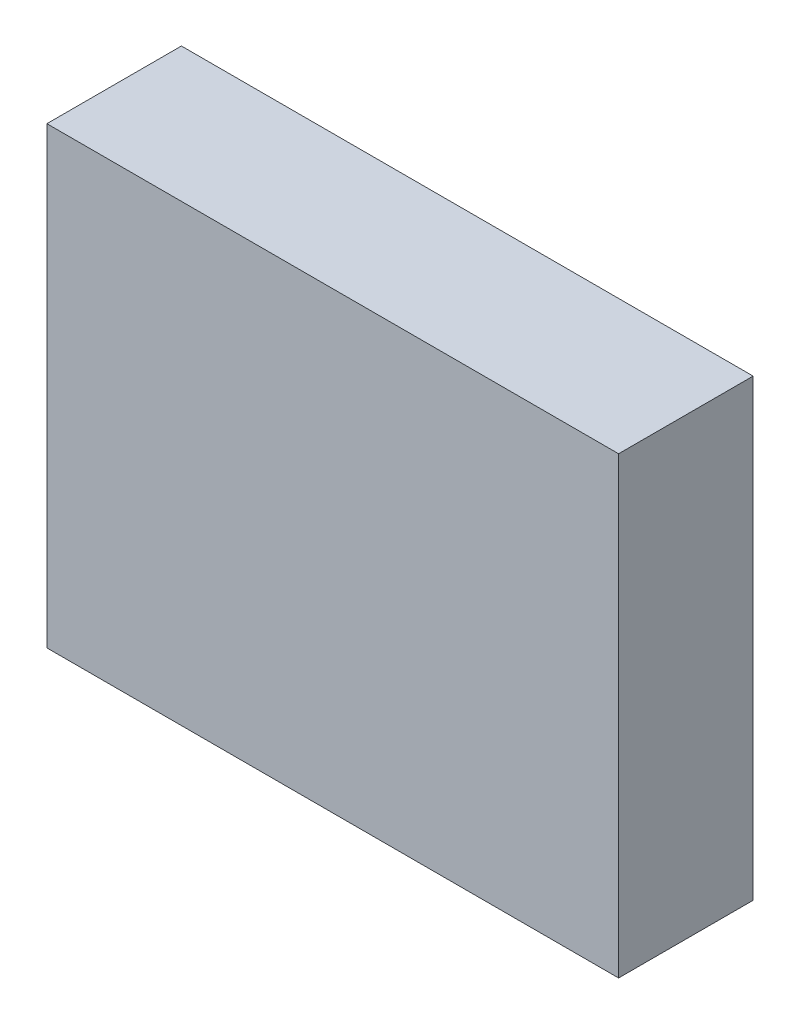
ISO-10303-21;
HEADER;
FILE_DESCRIPTION(('STEP AP214'),'2;1');
FILE_NAME('part.step','',(''),(''),'','','');
FILE_SCHEMA(('AUTOMOTIVE_DESIGN { 1 0 10303 214 1 1 1 1 }'));
ENDSEC;
DATA;
#1=APPLICATION_CONTEXT('core data for automotive mechanical design processes');
#2=APPLICATION_PROTOCOL_DEFINITION('international standard','automotive_design',2000,#1);
#3=PRODUCT_CONTEXT('',#1,'mechanical');
#4=PRODUCT('Part','Part','',(#3));
#5=PRODUCT_RELATED_PRODUCT_CATEGORY('part','',(#4));
#6=PRODUCT_DEFINITION_FORMATION('','',#4);
#7=PRODUCT_DEFINITION_CONTEXT('part definition',#1,'design');
#8=PRODUCT_DEFINITION('design','',#6,#7);
#9=PRODUCT_DEFINITION_SHAPE('','',#8);
#10=(LENGTH_UNIT() NAMED_UNIT(*) SI_UNIT(.MILLI.,.METRE.));
#11=(NAMED_UNIT(*) PLANE_ANGLE_UNIT() SI_UNIT($,.RADIAN.));
#12=(NAMED_UNIT(*) SI_UNIT($,.STERADIAN.) SOLID_ANGLE_UNIT());
#13=UNCERTAINTY_MEASURE_WITH_UNIT(LENGTH_MEASURE(1.E-05),#10,'distance_accuracy_value','');
#14=(GEOMETRIC_REPRESENTATION_CONTEXT(3) GLOBAL_UNCERTAINTY_ASSIGNED_CONTEXT((#13)) GLOBAL_UNIT_ASSIGNED_CONTEXT((#10,
#11,#12)) REPRESENTATION_CONTEXT('',''));
#15=CARTESIAN_POINT('',(0.,0.,0.));
#16=DIRECTION('',(0.,0.,1.));
#17=DIRECTION('',(1.,0.,0.));
#18=AXIS2_PLACEMENT_3D('',#15,#16,#17);
#19=CARTESIAN_POINT('',(-1.7,-1.35,0.));
#20=DIRECTION('',(1.,0.,0.));
#21=DIRECTION('',(0.,0.,1.));
#22=AXIS2_PLACEMENT_3D('',#19,#20,#21);
#23=PLANE('',#22);
#24=DIRECTION('',(0.,1.,0.));
#25=VECTOR('',#24,1.);
#26=CARTESIAN_POINT('',(-1.7,-1.35,0.8));
#27=LINE('',#26,#25);
#28=CARTESIAN_POINT('',(-1.7,-1.35,0.8));
#29=VERTEX_POINT('',#28);
#30=CARTESIAN_POINT('',(-1.7,1.35,0.8));
#31=VERTEX_POINT('',#30);
#32=EDGE_CURVE('P0_E11',#29,#31,#27,.T.);
#33=ORIENTED_EDGE('',*,*,#32,.T.);
#34=DIRECTION('',(0.,0.,1.));
#35=VECTOR('',#34,1.);
#36=CARTESIAN_POINT('',(-1.7,1.35,0.));
#37=LINE('',#36,#35);
#38=CARTESIAN_POINT('',(-1.7,1.35,0.));
#39=VERTEX_POINT('',#38);
#40=EDGE_CURVE('P0_E24',#39,#31,#37,.T.);
#41=ORIENTED_EDGE('',*,*,#40,.F.);
#42=DIRECTION('',(0.,1.,0.));
#43=VECTOR('',#42,1.);
#44=CARTESIAN_POINT('',(-1.7,-1.35,0.));
#45=LINE('',#44,#43);
#46=CARTESIAN_POINT('',(-1.7,-1.35,0.));
#47=VERTEX_POINT('',#46);
#48=EDGE_CURVE('P0_E86',#47,#39,#45,.T.);
#49=ORIENTED_EDGE('',*,*,#48,.F.);
#50=DIRECTION('',(0.,0.,1.));
#51=VECTOR('',#50,1.);
#52=CARTESIAN_POINT('',(-1.7,-1.35,0.));
#53=LINE('',#52,#51);
#54=EDGE_CURVE('P0_E36',#47,#29,#53,.T.);
#55=ORIENTED_EDGE('',*,*,#54,.T.);
#56=EDGE_LOOP('',(#33,#41,#49,#55));
#57=FACE_BOUND('',#56,.T.);
#58=ADVANCED_FACE('P0_F17',(#57),#23,.F.);
#59=CARTESIAN_POINT('',(1.7,-1.35,0.));
#60=DIRECTION('',(1.,0.,0.));
#61=DIRECTION('',(0.,0.,1.));
#62=AXIS2_PLACEMENT_3D('',#59,#60,#61);
#63=PLANE('',#62);
#64=DIRECTION('',(0.,0.,1.));
#65=VECTOR('',#64,1.);
#66=CARTESIAN_POINT('',(1.7,-1.35,0.));
#67=LINE('',#66,#65);
#68=CARTESIAN_POINT('',(1.7,-1.35,0.));
#69=VERTEX_POINT('',#68);
#70=CARTESIAN_POINT('',(1.7,-1.35,0.8));
#71=VERTEX_POINT('',#70);
#72=EDGE_CURVE('P0_E83',#69,#71,#67,.T.);
#73=ORIENTED_EDGE('',*,*,#72,.F.);
#74=DIRECTION('',(0.,1.,0.));
#75=VECTOR('',#74,1.);
#76=CARTESIAN_POINT('',(1.7,-1.35,0.));
#77=LINE('',#76,#75);
#78=CARTESIAN_POINT('',(1.7,1.35,0.));
#79=VERTEX_POINT('',#78);
#80=EDGE_CURVE('P0_E63',#69,#79,#77,.T.);
#81=ORIENTED_EDGE('',*,*,#80,.T.);
#82=DIRECTION('',(0.,0.,1.));
#83=VECTOR('',#82,1.);
#84=CARTESIAN_POINT('',(1.7,1.35,0.));
#85=LINE('',#84,#83);
#86=CARTESIAN_POINT('',(1.7,1.35,0.8));
#87=VERTEX_POINT('',#86);
#88=EDGE_CURVE('P0_E57',#79,#87,#85,.T.);
#89=ORIENTED_EDGE('',*,*,#88,.T.);
#90=DIRECTION('',(0.,1.,0.));
#91=VECTOR('',#90,1.);
#92=CARTESIAN_POINT('',(1.7,-1.35,0.8));
#93=LINE('',#92,#91);
#94=EDGE_CURVE('P0_E60',#71,#87,#93,.T.);
#95=ORIENTED_EDGE('',*,*,#94,.F.);
#96=EDGE_LOOP('',(#73,#81,#89,#95));
#97=FACE_BOUND('',#96,.T.);
#98=ADVANCED_FACE('P0_F59',(#97),#63,.T.);
#99=CARTESIAN_POINT('',(-1.7,-1.35,0.));
#100=DIRECTION('',(0.,1.,0.));
#101=DIRECTION('',(0.,0.,1.));
#102=AXIS2_PLACEMENT_3D('',#99,#100,#101);
#103=PLANE('',#102);
#104=ORIENTED_EDGE('',*,*,#72,.T.);
#105=DIRECTION('',(1.,0.,0.));
#106=VECTOR('',#105,1.);
#107=CARTESIAN_POINT('',(-1.7,-1.35,0.8));
#108=LINE('',#107,#106);
#109=EDGE_CURVE('P0_E71',#29,#71,#108,.T.);
#110=ORIENTED_EDGE('',*,*,#109,.F.);
#111=ORIENTED_EDGE('',*,*,#54,.F.);
#112=DIRECTION('',(1.,0.,0.));
#113=VECTOR('',#112,1.);
#114=CARTESIAN_POINT('',(-1.7,-1.35,0.));
#115=LINE('',#114,#113);
#116=EDGE_CURVE('P0_E76',#47,#69,#115,.T.);
#117=ORIENTED_EDGE('',*,*,#116,.T.);
#118=EDGE_LOOP('',(#104,#110,#111,#117));
#119=FACE_BOUND('',#118,.T.);
#120=ADVANCED_FACE('P0_F91',(#119),#103,.F.);
#121=CARTESIAN_POINT('',(-1.7,1.35,0.));
#122=DIRECTION('',(0.,1.,0.));
#123=DIRECTION('',(0.,0.,1.));
#124=AXIS2_PLACEMENT_3D('',#121,#122,#123);
#125=PLANE('',#124);
#126=DIRECTION('',(1.,0.,0.));
#127=VECTOR('',#126,1.);
#128=CARTESIAN_POINT('',(-1.7,1.35,0.));
#129=LINE('',#128,#127);
#130=EDGE_CURVE('P0_E74',#39,#79,#129,.T.);
#131=ORIENTED_EDGE('',*,*,#130,.F.);
#132=ORIENTED_EDGE('',*,*,#40,.T.);
#133=DIRECTION('',(1.,0.,0.));
#134=VECTOR('',#133,1.);
#135=CARTESIAN_POINT('',(-1.7,1.35,0.8));
#136=LINE('',#135,#134);
#137=EDGE_CURVE('P0_E69',#31,#87,#136,.T.);
#138=ORIENTED_EDGE('',*,*,#137,.T.);
#139=ORIENTED_EDGE('',*,*,#88,.F.);
#140=EDGE_LOOP('',(#131,#132,#138,#139));
#141=FACE_BOUND('',#140,.T.);
#142=ADVANCED_FACE('P0_F73',(#141),#125,.T.);
#143=CARTESIAN_POINT('',(-1.7,-1.35,0.));
#144=DIRECTION('',(0.,0.,1.));
#145=DIRECTION('',(1.,0.,0.));
#146=AXIS2_PLACEMENT_3D('',#143,#144,#145);
#147=PLANE('',#146);
#148=ORIENTED_EDGE('',*,*,#130,.T.);
#149=ORIENTED_EDGE('',*,*,#80,.F.);
#150=ORIENTED_EDGE('',*,*,#116,.F.);
#151=ORIENTED_EDGE('',*,*,#48,.T.);
#152=EDGE_LOOP('',(#148,#149,#150,#151));
#153=FACE_BOUND('',#152,.T.);
#154=ADVANCED_FACE('P0_F89',(#153),#147,.F.);
#155=CARTESIAN_POINT('',(-1.7,-1.35,0.8));
#156=DIRECTION('',(0.,0.,1.));
#157=DIRECTION('',(1.,0.,0.));
#158=AXIS2_PLACEMENT_3D('',#155,#156,#157);
#159=PLANE('',#158);
#160=ORIENTED_EDGE('',*,*,#32,.F.);
#161=ORIENTED_EDGE('',*,*,#109,.T.);
#162=ORIENTED_EDGE('',*,*,#94,.T.);
#163=ORIENTED_EDGE('',*,*,#137,.F.);
#164=EDGE_LOOP('',(#160,#161,#162,#163));
#165=FACE_BOUND('',#164,.T.);
#166=ADVANCED_FACE('P0_F68',(#165),#159,.T.);
#167=CLOSED_SHELL('',(#58,#98,#120,#142,#154,#166));
#168=MANIFOLD_SOLID_BREP('P0_B1',#167);
#169=CARTESIAN_POINT('',(0.6,-1.25,-0.003333333333333));
#170=DIRECTION('',(1.,0.,0.));
#171=DIRECTION('',(0.,0.,1.));
#172=AXIS2_PLACEMENT_3D('',#169,#170,#171);
#173=PLANE('',#172);
#174=DIRECTION('',(0.,1.,0.));
#175=VECTOR('',#174,1.);
#176=CARTESIAN_POINT('',(0.6,-1.25,0.006666666666667));
#177=LINE('',#176,#175);
#178=CARTESIAN_POINT('',(0.6,-1.25,0.006666666666667));
#179=VERTEX_POINT('',#178);
#180=CARTESIAN_POINT('',(0.6,-0.35,0.006666666666667));
#181=VERTEX_POINT('',#180);
#182=EDGE_CURVE('P1_E11',#179,#181,#177,.T.);
#183=ORIENTED_EDGE('',*,*,#182,.T.);
#184=DIRECTION('',(0.,0.,1.));
#185=VECTOR('',#184,1.);
#186=CARTESIAN_POINT('',(0.6,-0.35,-0.003333333333333));
#187=LINE('',#186,#185);
#188=CARTESIAN_POINT('',(0.6,-0.35,-0.003333333333333));
#189=VERTEX_POINT('',#188);
#190=EDGE_CURVE('P1_E24',#189,#181,#187,.T.);
#191=ORIENTED_EDGE('',*,*,#190,.F.);
#192=DIRECTION('',(0.,1.,0.));
#193=VECTOR('',#192,1.);
#194=CARTESIAN_POINT('',(0.6,-1.25,-0.003333333333333));
#195=LINE('',#194,#193);
#196=CARTESIAN_POINT('',(0.6,-1.25,-0.003333333333333));
#197=VERTEX_POINT('',#196);
#198=EDGE_CURVE('P1_E86',#197,#189,#195,.T.);
#199=ORIENTED_EDGE('',*,*,#198,.F.);
#200=DIRECTION('',(0.,0.,1.));
#201=VECTOR('',#200,1.);
#202=CARTESIAN_POINT('',(0.6,-1.25,-0.003333333333333));
#203=LINE('',#202,#201);
#204=EDGE_CURVE('P1_E36',#197,#179,#203,.T.);
#205=ORIENTED_EDGE('',*,*,#204,.T.);
#206=EDGE_LOOP('',(#183,#191,#199,#205));
#207=FACE_BOUND('',#206,.T.);
#208=ADVANCED_FACE('P1_F17',(#207),#173,.F.);
#209=CARTESIAN_POINT('',(1.6,-1.25,-0.003333333333333));
#210=DIRECTION('',(1.,0.,0.));
#211=DIRECTION('',(0.,0.,1.));
#212=AXIS2_PLACEMENT_3D('',#209,#210,#211);
#213=PLANE('',#212);
#214=DIRECTION('',(0.,0.,1.));
#215=VECTOR('',#214,1.);
#216=CARTESIAN_POINT('',(1.6,-1.25,-0.003333333333333));
#217=LINE('',#216,#215);
#218=CARTESIAN_POINT('',(1.6,-1.25,-0.003333333333333));
#219=VERTEX_POINT('',#218);
#220=CARTESIAN_POINT('',(1.6,-1.25,0.006666666666667));
#221=VERTEX_POINT('',#220);
#222=EDGE_CURVE('P1_E83',#219,#221,#217,.T.);
#223=ORIENTED_EDGE('',*,*,#222,.F.);
#224=DIRECTION('',(0.,1.,0.));
#225=VECTOR('',#224,1.);
#226=CARTESIAN_POINT('',(1.6,-1.25,-0.003333333333333));
#227=LINE('',#226,#225);
#228=CARTESIAN_POINT('',(1.6,-0.35,-0.003333333333333));
#229=VERTEX_POINT('',#228);
#230=EDGE_CURVE('P1_E63',#219,#229,#227,.T.);
#231=ORIENTED_EDGE('',*,*,#230,.T.);
#232=DIRECTION('',(0.,0.,1.));
#233=VECTOR('',#232,1.);
#234=CARTESIAN_POINT('',(1.6,-0.35,-0.003333333333333));
#235=LINE('',#234,#233);
#236=CARTESIAN_POINT('',(1.6,-0.35,0.006666666666667));
#237=VERTEX_POINT('',#236);
#238=EDGE_CURVE('P1_E56',#229,#237,#235,.T.);
#239=ORIENTED_EDGE('',*,*,#238,.T.);
#240=DIRECTION('',(0.,1.,0.));
#241=VECTOR('',#240,1.);
#242=CARTESIAN_POINT('',(1.6,-1.25,0.006666666666667));
#243=LINE('',#242,#241);
#244=EDGE_CURVE('P1_E60',#221,#237,#243,.T.);
#245=ORIENTED_EDGE('',*,*,#244,.F.);
#246=EDGE_LOOP('',(#223,#231,#239,#245));
#247=FACE_BOUND('',#246,.T.);
#248=ADVANCED_FACE('P1_F59',(#247),#213,.T.);
#249=CARTESIAN_POINT('',(0.6,-1.25,-0.003333333333333));
#250=DIRECTION('',(0.,1.,0.));
#251=DIRECTION('',(0.,0.,1.));
#252=AXIS2_PLACEMENT_3D('',#249,#250,#251);
#253=PLANE('',#252);
#254=ORIENTED_EDGE('',*,*,#222,.T.);
#255=DIRECTION('',(1.,0.,0.));
#256=VECTOR('',#255,1.);
#257=CARTESIAN_POINT('',(0.6,-1.25,0.006666666666667));
#258=LINE('',#257,#256);
#259=EDGE_CURVE('P1_E71',#179,#221,#258,.T.);
#260=ORIENTED_EDGE('',*,*,#259,.F.);
#261=ORIENTED_EDGE('',*,*,#204,.F.);
#262=DIRECTION('',(1.,0.,0.));
#263=VECTOR('',#262,1.);
#264=CARTESIAN_POINT('',(0.6,-1.25,-0.003333333333333));
#265=LINE('',#264,#263);
#266=EDGE_CURVE('P1_E77',#197,#219,#265,.T.);
#267=ORIENTED_EDGE('',*,*,#266,.T.);
#268=EDGE_LOOP('',(#254,#260,#261,#267));
#269=FACE_BOUND('',#268,.T.);
#270=ADVANCED_FACE('P1_F95',(#269),#253,.F.);
#271=CARTESIAN_POINT('',(0.6,-0.35,-0.003333333333333));
#272=DIRECTION('',(0.,1.,0.));
#273=DIRECTION('',(0.,0.,1.));
#274=AXIS2_PLACEMENT_3D('',#271,#272,#273);
#275=PLANE('',#274);
#276=DIRECTION('',(1.,0.,0.));
#277=VECTOR('',#276,1.);
#278=CARTESIAN_POINT('',(0.6,-0.35,-0.003333333333333));
#279=LINE('',#278,#277);
#280=EDGE_CURVE('P1_E75',#189,#229,#279,.T.);
#281=ORIENTED_EDGE('',*,*,#280,.F.);
#282=ORIENTED_EDGE('',*,*,#190,.T.);
#283=DIRECTION('',(1.,0.,0.));
#284=VECTOR('',#283,1.);
#285=CARTESIAN_POINT('',(0.6,-0.35,0.006666666666667));
#286=LINE('',#285,#284);
#287=EDGE_CURVE('P1_E70',#181,#237,#286,.T.);
#288=ORIENTED_EDGE('',*,*,#287,.T.);
#289=ORIENTED_EDGE('',*,*,#238,.F.);
#290=EDGE_LOOP('',(#281,#282,#288,#289));
#291=FACE_BOUND('',#290,.T.);
#292=ADVANCED_FACE('P1_F74',(#291),#275,.T.);
#293=CARTESIAN_POINT('',(0.6,-1.25,-0.003333333333333));
#294=DIRECTION('',(0.,0.,1.));
#295=DIRECTION('',(1.,0.,0.));
#296=AXIS2_PLACEMENT_3D('',#293,#294,#295);
#297=PLANE('',#296);
#298=ORIENTED_EDGE('',*,*,#280,.T.);
#299=ORIENTED_EDGE('',*,*,#230,.F.);
#300=ORIENTED_EDGE('',*,*,#266,.F.);
#301=ORIENTED_EDGE('',*,*,#198,.T.);
#302=EDGE_LOOP('',(#298,#299,#300,#301));
#303=FACE_BOUND('',#302,.T.);
#304=ADVANCED_FACE('P1_F89',(#303),#297,.F.);
#305=CARTESIAN_POINT('',(0.6,-1.25,0.006666666666667));
#306=DIRECTION('',(0.,0.,1.));
#307=DIRECTION('',(1.,0.,0.));
#308=AXIS2_PLACEMENT_3D('',#305,#306,#307);
#309=PLANE('',#308);
#310=ORIENTED_EDGE('',*,*,#182,.F.);
#311=ORIENTED_EDGE('',*,*,#259,.T.);
#312=ORIENTED_EDGE('',*,*,#244,.T.);
#313=ORIENTED_EDGE('',*,*,#287,.F.);
#314=EDGE_LOOP('',(#310,#311,#312,#313));
#315=FACE_BOUND('',#314,.T.);
#316=ADVANCED_FACE('P1_F69',(#315),#309,.T.);
#317=CLOSED_SHELL('',(#208,#248,#270,#292,#304,#316));
#318=MANIFOLD_SOLID_BREP('P1_B1',#317);
#319=CARTESIAN_POINT('',(0.6,0.35,-0.003333333333333));
#320=DIRECTION('',(1.,0.,0.));
#321=DIRECTION('',(0.,0.,1.));
#322=AXIS2_PLACEMENT_3D('',#319,#320,#321);
#323=PLANE('',#322);
#324=DIRECTION('',(0.,1.,0.));
#325=VECTOR('',#324,1.);
#326=CARTESIAN_POINT('',(0.6,0.35,0.006666666666667));
#327=LINE('',#326,#325);
#328=CARTESIAN_POINT('',(0.6,0.35,0.006666666666667));
#329=VERTEX_POINT('',#328);
#330=CARTESIAN_POINT('',(0.6,1.25,0.006666666666667));
#331=VERTEX_POINT('',#330);
#332=EDGE_CURVE('P2_E11',#329,#331,#327,.T.);
#333=ORIENTED_EDGE('',*,*,#332,.T.);
#334=DIRECTION('',(0.,0.,1.));
#335=VECTOR('',#334,1.);
#336=CARTESIAN_POINT('',(0.6,1.25,-0.003333333333333));
#337=LINE('',#336,#335);
#338=CARTESIAN_POINT('',(0.6,1.25,-0.003333333333333));
#339=VERTEX_POINT('',#338);
#340=EDGE_CURVE('P2_E24',#339,#331,#337,.T.);
#341=ORIENTED_EDGE('',*,*,#340,.F.);
#342=DIRECTION('',(0.,1.,0.));
#343=VECTOR('',#342,1.);
#344=CARTESIAN_POINT('',(0.6,0.35,-0.003333333333333));
#345=LINE('',#344,#343);
#346=CARTESIAN_POINT('',(0.6,0.35,-0.003333333333333));
#347=VERTEX_POINT('',#346);
#348=EDGE_CURVE('P2_E86',#347,#339,#345,.T.);
#349=ORIENTED_EDGE('',*,*,#348,.F.);
#350=DIRECTION('',(0.,0.,1.));
#351=VECTOR('',#350,1.);
#352=CARTESIAN_POINT('',(0.6,0.35,-0.003333333333333));
#353=LINE('',#352,#351);
#354=EDGE_CURVE('P2_E36',#347,#329,#353,.T.);
#355=ORIENTED_EDGE('',*,*,#354,.T.);
#356=EDGE_LOOP('',(#333,#341,#349,#355));
#357=FACE_BOUND('',#356,.T.);
#358=ADVANCED_FACE('P2_F17',(#357),#323,.F.);
#359=CARTESIAN_POINT('',(1.6,0.35,-0.003333333333333));
#360=DIRECTION('',(1.,0.,0.));
#361=DIRECTION('',(0.,0.,1.));
#362=AXIS2_PLACEMENT_3D('',#359,#360,#361);
#363=PLANE('',#362);
#364=DIRECTION('',(0.,0.,1.));
#365=VECTOR('',#364,1.);
#366=CARTESIAN_POINT('',(1.6,0.35,-0.003333333333333));
#367=LINE('',#366,#365);
#368=CARTESIAN_POINT('',(1.6,0.35,-0.003333333333333));
#369=VERTEX_POINT('',#368);
#370=CARTESIAN_POINT('',(1.6,0.35,0.006666666666667));
#371=VERTEX_POINT('',#370);
#372=EDGE_CURVE('P2_E83',#369,#371,#367,.T.);
#373=ORIENTED_EDGE('',*,*,#372,.F.);
#374=DIRECTION('',(0.,1.,0.));
#375=VECTOR('',#374,1.);
#376=CARTESIAN_POINT('',(1.6,0.35,-0.003333333333333));
#377=LINE('',#376,#375);
#378=CARTESIAN_POINT('',(1.6,1.25,-0.003333333333333));
#379=VERTEX_POINT('',#378);
#380=EDGE_CURVE('P2_E63',#369,#379,#377,.T.);
#381=ORIENTED_EDGE('',*,*,#380,.T.);
#382=DIRECTION('',(0.,0.,1.));
#383=VECTOR('',#382,1.);
#384=CARTESIAN_POINT('',(1.6,1.25,-0.003333333333333));
#385=LINE('',#384,#383);
#386=CARTESIAN_POINT('',(1.6,1.25,0.006666666666667));
#387=VERTEX_POINT('',#386);
#388=EDGE_CURVE('P2_E57',#379,#387,#385,.T.);
#389=ORIENTED_EDGE('',*,*,#388,.T.);
#390=DIRECTION('',(0.,1.,0.));
#391=VECTOR('',#390,1.);
#392=CARTESIAN_POINT('',(1.6,0.35,0.006666666666667));
#393=LINE('',#392,#391);
#394=EDGE_CURVE('P2_E60',#371,#387,#393,.T.);
#395=ORIENTED_EDGE('',*,*,#394,.F.);
#396=EDGE_LOOP('',(#373,#381,#389,#395));
#397=FACE_BOUND('',#396,.T.);
#398=ADVANCED_FACE('P2_F59',(#397),#363,.T.);
#399=CARTESIAN_POINT('',(0.6,0.35,-0.003333333333333));
#400=DIRECTION('',(0.,1.,0.));
#401=DIRECTION('',(0.,0.,1.));
#402=AXIS2_PLACEMENT_3D('',#399,#400,#401);
#403=PLANE('',#402);
#404=ORIENTED_EDGE('',*,*,#372,.T.);
#405=DIRECTION('',(1.,0.,0.));
#406=VECTOR('',#405,1.);
#407=CARTESIAN_POINT('',(0.6,0.35,0.006666666666667));
#408=LINE('',#407,#406);
#409=EDGE_CURVE('P2_E71',#329,#371,#408,.T.);
#410=ORIENTED_EDGE('',*,*,#409,.F.);
#411=ORIENTED_EDGE('',*,*,#354,.F.);
#412=DIRECTION('',(1.,0.,0.));
#413=VECTOR('',#412,1.);
#414=CARTESIAN_POINT('',(0.6,0.35,-0.003333333333333));
#415=LINE('',#414,#413);
#416=EDGE_CURVE('P2_E76',#347,#369,#415,.T.);
#417=ORIENTED_EDGE('',*,*,#416,.T.);
#418=EDGE_LOOP('',(#404,#410,#411,#417));
#419=FACE_BOUND('',#418,.T.);
#420=ADVANCED_FACE('P2_F91',(#419),#403,.F.);
#421=CARTESIAN_POINT('',(0.6,1.25,-0.003333333333333));
#422=DIRECTION('',(0.,1.,0.));
#423=DIRECTION('',(0.,0.,1.));
#424=AXIS2_PLACEMENT_3D('',#421,#422,#423);
#425=PLANE('',#424);
#426=DIRECTION('',(1.,0.,0.));
#427=VECTOR('',#426,1.);
#428=CARTESIAN_POINT('',(0.6,1.25,-0.003333333333333));
#429=LINE('',#428,#427);
#430=EDGE_CURVE('P2_E74',#339,#379,#429,.T.);
#431=ORIENTED_EDGE('',*,*,#430,.F.);
#432=ORIENTED_EDGE('',*,*,#340,.T.);
#433=DIRECTION('',(1.,0.,0.));
#434=VECTOR('',#433,1.);
#435=CARTESIAN_POINT('',(0.6,1.25,0.006666666666667));
#436=LINE('',#435,#434);
#437=EDGE_CURVE('P2_E69',#331,#387,#436,.T.);
#438=ORIENTED_EDGE('',*,*,#437,.T.);
#439=ORIENTED_EDGE('',*,*,#388,.F.);
#440=EDGE_LOOP('',(#431,#432,#438,#439));
#441=FACE_BOUND('',#440,.T.);
#442=ADVANCED_FACE('P2_F73',(#441),#425,.T.);
#443=CARTESIAN_POINT('',(0.6,0.35,-0.003333333333333));
#444=DIRECTION('',(0.,0.,1.));
#445=DIRECTION('',(1.,0.,0.));
#446=AXIS2_PLACEMENT_3D('',#443,#444,#445);
#447=PLANE('',#446);
#448=ORIENTED_EDGE('',*,*,#430,.T.);
#449=ORIENTED_EDGE('',*,*,#380,.F.);
#450=ORIENTED_EDGE('',*,*,#416,.F.);
#451=ORIENTED_EDGE('',*,*,#348,.T.);
#452=EDGE_LOOP('',(#448,#449,#450,#451));
#453=FACE_BOUND('',#452,.T.);
#454=ADVANCED_FACE('P2_F89',(#453),#447,.F.);
#455=CARTESIAN_POINT('',(0.6,0.35,0.006666666666667));
#456=DIRECTION('',(0.,0.,1.));
#457=DIRECTION('',(1.,0.,0.));
#458=AXIS2_PLACEMENT_3D('',#455,#456,#457);
#459=PLANE('',#458);
#460=ORIENTED_EDGE('',*,*,#332,.F.);
#461=ORIENTED_EDGE('',*,*,#409,.T.);
#462=ORIENTED_EDGE('',*,*,#394,.T.);
#463=ORIENTED_EDGE('',*,*,#437,.F.);
#464=EDGE_LOOP('',(#460,#461,#462,#463));
#465=FACE_BOUND('',#464,.T.);
#466=ADVANCED_FACE('P2_F68',(#465),#459,.T.);
#467=CLOSED_SHELL('',(#358,#398,#420,#442,#454,#466));
#468=MANIFOLD_SOLID_BREP('P2_B1',#467);
#469=CARTESIAN_POINT('',(-1.6,-1.25,-0.003333333333333));
#470=DIRECTION('',(1.,0.,0.));
#471=DIRECTION('',(0.,0.,1.));
#472=AXIS2_PLACEMENT_3D('',#469,#470,#471);
#473=PLANE('',#472);
#474=DIRECTION('',(0.,1.,0.));
#475=VECTOR('',#474,1.);
#476=CARTESIAN_POINT('',(-1.6,-1.25,0.006666666666667));
#477=LINE('',#476,#475);
#478=CARTESIAN_POINT('',(-1.6,-1.25,0.006666666666667));
#479=VERTEX_POINT('',#478);
#480=CARTESIAN_POINT('',(-1.6,-0.35,0.006666666666667));
#481=VERTEX_POINT('',#480);
#482=EDGE_CURVE('P3_E11',#479,#481,#477,.T.);
#483=ORIENTED_EDGE('',*,*,#482,.T.);
#484=DIRECTION('',(0.,0.,1.));
#485=VECTOR('',#484,1.);
#486=CARTESIAN_POINT('',(-1.6,-0.35,-0.003333333333333));
#487=LINE('',#486,#485);
#488=CARTESIAN_POINT('',(-1.6,-0.35,-0.003333333333333));
#489=VERTEX_POINT('',#488);
#490=EDGE_CURVE('P3_E24',#489,#481,#487,.T.);
#491=ORIENTED_EDGE('',*,*,#490,.F.);
#492=DIRECTION('',(0.,1.,0.));
#493=VECTOR('',#492,1.);
#494=CARTESIAN_POINT('',(-1.6,-1.25,-0.003333333333333));
#495=LINE('',#494,#493);
#496=CARTESIAN_POINT('',(-1.6,-1.25,-0.003333333333333));
#497=VERTEX_POINT('',#496);
#498=EDGE_CURVE('P3_E86',#497,#489,#495,.T.);
#499=ORIENTED_EDGE('',*,*,#498,.F.);
#500=DIRECTION('',(0.,0.,1.));
#501=VECTOR('',#500,1.);
#502=CARTESIAN_POINT('',(-1.6,-1.25,-0.003333333333333));
#503=LINE('',#502,#501);
#504=EDGE_CURVE('P3_E36',#497,#479,#503,.T.);
#505=ORIENTED_EDGE('',*,*,#504,.T.);
#506=EDGE_LOOP('',(#483,#491,#499,#505));
#507=FACE_BOUND('',#506,.T.);
#508=ADVANCED_FACE('P3_F17',(#507),#473,.F.);
#509=CARTESIAN_POINT('',(-0.6,-1.25,-0.003333333333333));
#510=DIRECTION('',(1.,0.,0.));
#511=DIRECTION('',(0.,0.,1.));
#512=AXIS2_PLACEMENT_3D('',#509,#510,#511);
#513=PLANE('',#512);
#514=DIRECTION('',(0.,0.,1.));
#515=VECTOR('',#514,1.);
#516=CARTESIAN_POINT('',(-0.6,-1.25,-0.003333333333333));
#517=LINE('',#516,#515);
#518=CARTESIAN_POINT('',(-0.6,-1.25,-0.003333333333333));
#519=VERTEX_POINT('',#518);
#520=CARTESIAN_POINT('',(-0.6,-1.25,0.006666666666667));
#521=VERTEX_POINT('',#520);
#522=EDGE_CURVE('P3_E83',#519,#521,#517,.T.);
#523=ORIENTED_EDGE('',*,*,#522,.F.);
#524=DIRECTION('',(0.,1.,0.));
#525=VECTOR('',#524,1.);
#526=CARTESIAN_POINT('',(-0.6,-1.25,-0.003333333333333));
#527=LINE('',#526,#525);
#528=CARTESIAN_POINT('',(-0.6,-0.35,-0.003333333333333));
#529=VERTEX_POINT('',#528);
#530=EDGE_CURVE('P3_E63',#519,#529,#527,.T.);
#531=ORIENTED_EDGE('',*,*,#530,.T.);
#532=DIRECTION('',(0.,0.,1.));
#533=VECTOR('',#532,1.);
#534=CARTESIAN_POINT('',(-0.6,-0.35,-0.003333333333333));
#535=LINE('',#534,#533);
#536=CARTESIAN_POINT('',(-0.6,-0.35,0.006666666666667));
#537=VERTEX_POINT('',#536);
#538=EDGE_CURVE('P3_E57',#529,#537,#535,.T.);
#539=ORIENTED_EDGE('',*,*,#538,.T.);
#540=DIRECTION('',(0.,1.,0.));
#541=VECTOR('',#540,1.);
#542=CARTESIAN_POINT('',(-0.6,-1.25,0.006666666666667));
#543=LINE('',#542,#541);
#544=EDGE_CURVE('P3_E60',#521,#537,#543,.T.);
#545=ORIENTED_EDGE('',*,*,#544,.F.);
#546=EDGE_LOOP('',(#523,#531,#539,#545));
#547=FACE_BOUND('',#546,.T.);
#548=ADVANCED_FACE('P3_F59',(#547),#513,.T.);
#549=CARTESIAN_POINT('',(-1.6,-1.25,-0.003333333333333));
#550=DIRECTION('',(0.,1.,0.));
#551=DIRECTION('',(0.,0.,1.));
#552=AXIS2_PLACEMENT_3D('',#549,#550,#551);
#553=PLANE('',#552);
#554=ORIENTED_EDGE('',*,*,#522,.T.);
#555=DIRECTION('',(1.,0.,0.));
#556=VECTOR('',#555,1.);
#557=CARTESIAN_POINT('',(-1.6,-1.25,0.006666666666667));
#558=LINE('',#557,#556);
#559=EDGE_CURVE('P3_E71',#479,#521,#558,.T.);
#560=ORIENTED_EDGE('',*,*,#559,.F.);
#561=ORIENTED_EDGE('',*,*,#504,.F.);
#562=DIRECTION('',(1.,0.,0.));
#563=VECTOR('',#562,1.);
#564=CARTESIAN_POINT('',(-1.6,-1.25,-0.003333333333333));
#565=LINE('',#564,#563);
#566=EDGE_CURVE('P3_E76',#497,#519,#565,.T.);
#567=ORIENTED_EDGE('',*,*,#566,.T.);
#568=EDGE_LOOP('',(#554,#560,#561,#567));
#569=FACE_BOUND('',#568,.T.);
#570=ADVANCED_FACE('P3_F91',(#569),#553,.F.);
#571=CARTESIAN_POINT('',(-1.6,-0.35,-0.003333333333333));
#572=DIRECTION('',(0.,1.,0.));
#573=DIRECTION('',(0.,0.,1.));
#574=AXIS2_PLACEMENT_3D('',#571,#572,#573);
#575=PLANE('',#574);
#576=DIRECTION('',(1.,0.,0.));
#577=VECTOR('',#576,1.);
#578=CARTESIAN_POINT('',(-1.6,-0.35,-0.003333333333333));
#579=LINE('',#578,#577);
#580=EDGE_CURVE('P3_E74',#489,#529,#579,.T.);
#581=ORIENTED_EDGE('',*,*,#580,.F.);
#582=ORIENTED_EDGE('',*,*,#490,.T.);
#583=DIRECTION('',(1.,0.,0.));
#584=VECTOR('',#583,1.);
#585=CARTESIAN_POINT('',(-1.6,-0.35,0.006666666666667));
#586=LINE('',#585,#584);
#587=EDGE_CURVE('P3_E69',#481,#537,#586,.T.);
#588=ORIENTED_EDGE('',*,*,#587,.T.);
#589=ORIENTED_EDGE('',*,*,#538,.F.);
#590=EDGE_LOOP('',(#581,#582,#588,#589));
#591=FACE_BOUND('',#590,.T.);
#592=ADVANCED_FACE('P3_F73',(#591),#575,.T.);
#593=CARTESIAN_POINT('',(-1.6,-1.25,-0.003333333333333));
#594=DIRECTION('',(0.,0.,1.));
#595=DIRECTION('',(1.,0.,0.));
#596=AXIS2_PLACEMENT_3D('',#593,#594,#595);
#597=PLANE('',#596);
#598=ORIENTED_EDGE('',*,*,#580,.T.);
#599=ORIENTED_EDGE('',*,*,#530,.F.);
#600=ORIENTED_EDGE('',*,*,#566,.F.);
#601=ORIENTED_EDGE('',*,*,#498,.T.);
#602=EDGE_LOOP('',(#598,#599,#600,#601));
#603=FACE_BOUND('',#602,.T.);
#604=ADVANCED_FACE('P3_F89',(#603),#597,.F.);
#605=CARTESIAN_POINT('',(-1.6,-1.25,0.006666666666667));
#606=DIRECTION('',(0.,0.,1.));
#607=DIRECTION('',(1.,0.,0.));
#608=AXIS2_PLACEMENT_3D('',#605,#606,#607);
#609=PLANE('',#608);
#610=ORIENTED_EDGE('',*,*,#482,.F.);
#611=ORIENTED_EDGE('',*,*,#559,.T.);
#612=ORIENTED_EDGE('',*,*,#544,.T.);
#613=ORIENTED_EDGE('',*,*,#587,.F.);
#614=EDGE_LOOP('',(#610,#611,#612,#613));
#615=FACE_BOUND('',#614,.T.);
#616=ADVANCED_FACE('P3_F68',(#615),#609,.T.);
#617=CLOSED_SHELL('',(#508,#548,#570,#592,#604,#616));
#618=MANIFOLD_SOLID_BREP('P3_B1',#617);
#619=CARTESIAN_POINT('',(-1.6,0.35,-0.003333333333333));
#620=DIRECTION('',(1.,0.,0.));
#621=DIRECTION('',(0.,0.,1.));
#622=AXIS2_PLACEMENT_3D('',#619,#620,#621);
#623=PLANE('',#622);
#624=DIRECTION('',(0.,1.,0.));
#625=VECTOR('',#624,1.);
#626=CARTESIAN_POINT('',(-1.6,0.35,0.006666666666667));
#627=LINE('',#626,#625);
#628=CARTESIAN_POINT('',(-1.6,0.35,0.006666666666667));
#629=VERTEX_POINT('',#628);
#630=CARTESIAN_POINT('',(-1.6,1.25,0.006666666666667));
#631=VERTEX_POINT('',#630);
#632=EDGE_CURVE('P4_E10',#629,#631,#627,.T.);
#633=ORIENTED_EDGE('',*,*,#632,.T.);
#634=DIRECTION('',(0.,0.,1.));
#635=VECTOR('',#634,1.);
#636=CARTESIAN_POINT('',(-1.6,1.25,-0.003333333333333));
#637=LINE('',#636,#635);
#638=CARTESIAN_POINT('',(-1.6,1.25,-0.003333333333333));
#639=VERTEX_POINT('',#638);
#640=EDGE_CURVE('P4_E23',#639,#631,#637,.T.);
#641=ORIENTED_EDGE('',*,*,#640,.F.);
#642=DIRECTION('',(0.,1.,0.));
#643=VECTOR('',#642,1.);
#644=CARTESIAN_POINT('',(-1.6,0.35,-0.003333333333333));
#645=LINE('',#644,#643);
#646=CARTESIAN_POINT('',(-1.6,0.35,-0.003333333333333));
#647=VERTEX_POINT('',#646);
#648=EDGE_CURVE('P4_E85',#647,#639,#645,.T.);
#649=ORIENTED_EDGE('',*,*,#648,.F.);
#650=DIRECTION('',(0.,0.,1.));
#651=VECTOR('',#650,1.);
#652=CARTESIAN_POINT('',(-1.6,0.35,-0.003333333333333));
#653=LINE('',#652,#651);
#654=EDGE_CURVE('P4_E35',#647,#629,#653,.T.);
#655=ORIENTED_EDGE('',*,*,#654,.T.);
#656=EDGE_LOOP('',(#633,#641,#649,#655));
#657=FACE_BOUND('',#656,.T.);
#658=ADVANCED_FACE('P4_F16',(#657),#623,.F.);
#659=CARTESIAN_POINT('',(-0.6,0.35,-0.003333333333333));
#660=DIRECTION('',(1.,0.,0.));
#661=DIRECTION('',(0.,0.,1.));
#662=AXIS2_PLACEMENT_3D('',#659,#660,#661);
#663=PLANE('',#662);
#664=DIRECTION('',(0.,0.,1.));
#665=VECTOR('',#664,1.);
#666=CARTESIAN_POINT('',(-0.6,0.35,-0.003333333333333));
#667=LINE('',#666,#665);
#668=CARTESIAN_POINT('',(-0.6,0.35,-0.003333333333333));
#669=VERTEX_POINT('',#668);
#670=CARTESIAN_POINT('',(-0.6,0.35,0.006666666666667));
#671=VERTEX_POINT('',#670);
#672=EDGE_CURVE('P4_E82',#669,#671,#667,.T.);
#673=ORIENTED_EDGE('',*,*,#672,.F.);
#674=DIRECTION('',(0.,1.,0.));
#675=VECTOR('',#674,1.);
#676=CARTESIAN_POINT('',(-0.6,0.35,-0.003333333333333));
#677=LINE('',#676,#675);
#678=CARTESIAN_POINT('',(-0.6,1.25,-0.003333333333333));
#679=VERTEX_POINT('',#678);
#680=EDGE_CURVE('P4_E62',#669,#679,#677,.T.);
#681=ORIENTED_EDGE('',*,*,#680,.T.);
#682=DIRECTION('',(0.,0.,1.));
#683=VECTOR('',#682,1.);
#684=CARTESIAN_POINT('',(-0.6,1.25,-0.003333333333333));
#685=LINE('',#684,#683);
#686=CARTESIAN_POINT('',(-0.6,1.25,0.006666666666667));
#687=VERTEX_POINT('',#686);
#688=EDGE_CURVE('P4_E56',#679,#687,#685,.T.);
#689=ORIENTED_EDGE('',*,*,#688,.T.);
#690=DIRECTION('',(0.,1.,0.));
#691=VECTOR('',#690,1.);
#692=CARTESIAN_POINT('',(-0.6,0.35,0.006666666666667));
#693=LINE('',#692,#691);
#694=EDGE_CURVE('P4_E59',#671,#687,#693,.T.);
#695=ORIENTED_EDGE('',*,*,#694,.F.);
#696=EDGE_LOOP('',(#673,#681,#689,#695));
#697=FACE_BOUND('',#696,.T.);
#698=ADVANCED_FACE('P4_F58',(#697),#663,.T.);
#699=CARTESIAN_POINT('',(-1.6,0.35,-0.003333333333333));
#700=DIRECTION('',(0.,1.,0.));
#701=DIRECTION('',(0.,0.,1.));
#702=AXIS2_PLACEMENT_3D('',#699,#700,#701);
#703=PLANE('',#702);
#704=ORIENTED_EDGE('',*,*,#672,.T.);
#705=DIRECTION('',(1.,0.,0.));
#706=VECTOR('',#705,1.);
#707=CARTESIAN_POINT('',(-1.6,0.35,0.006666666666667));
#708=LINE('',#707,#706);
#709=EDGE_CURVE('P4_E70',#629,#671,#708,.T.);
#710=ORIENTED_EDGE('',*,*,#709,.F.);
#711=ORIENTED_EDGE('',*,*,#654,.F.);
#712=DIRECTION('',(1.,0.,0.));
#713=VECTOR('',#712,1.);
#714=CARTESIAN_POINT('',(-1.6,0.35,-0.003333333333333));
#715=LINE('',#714,#713);
#716=EDGE_CURVE('P4_E75',#647,#669,#715,.T.);
#717=ORIENTED_EDGE('',*,*,#716,.T.);
#718=EDGE_LOOP('',(#704,#710,#711,#717));
#719=FACE_BOUND('',#718,.T.);
#720=ADVANCED_FACE('P4_F90',(#719),#703,.F.);
#721=CARTESIAN_POINT('',(-1.6,1.25,-0.003333333333333));
#722=DIRECTION('',(0.,1.,0.));
#723=DIRECTION('',(0.,0.,1.));
#724=AXIS2_PLACEMENT_3D('',#721,#722,#723);
#725=PLANE('',#724);
#726=DIRECTION('',(1.,0.,0.));
#727=VECTOR('',#726,1.);
#728=CARTESIAN_POINT('',(-1.6,1.25,-0.003333333333333));
#729=LINE('',#728,#727);
#730=EDGE_CURVE('P4_E73',#639,#679,#729,.T.);
#731=ORIENTED_EDGE('',*,*,#730,.F.);
#732=ORIENTED_EDGE('',*,*,#640,.T.);
#733=DIRECTION('',(1.,0.,0.));
#734=VECTOR('',#733,1.);
#735=CARTESIAN_POINT('',(-1.6,1.25,0.006666666666667));
#736=LINE('',#735,#734);
#737=EDGE_CURVE('P4_E68',#631,#687,#736,.T.);
#738=ORIENTED_EDGE('',*,*,#737,.T.);
#739=ORIENTED_EDGE('',*,*,#688,.F.);
#740=EDGE_LOOP('',(#731,#732,#738,#739));
#741=FACE_BOUND('',#740,.T.);
#742=ADVANCED_FACE('P4_F72',(#741),#725,.T.);
#743=CARTESIAN_POINT('',(-1.6,0.35,-0.003333333333333));
#744=DIRECTION('',(0.,0.,1.));
#745=DIRECTION('',(1.,0.,0.));
#746=AXIS2_PLACEMENT_3D('',#743,#744,#745);
#747=PLANE('',#746);
#748=ORIENTED_EDGE('',*,*,#730,.T.);
#749=ORIENTED_EDGE('',*,*,#680,.F.);
#750=ORIENTED_EDGE('',*,*,#716,.F.);
#751=ORIENTED_EDGE('',*,*,#648,.T.);
#752=EDGE_LOOP('',(#748,#749,#750,#751));
#753=FACE_BOUND('',#752,.T.);
#754=ADVANCED_FACE('P4_F88',(#753),#747,.F.);
#755=CARTESIAN_POINT('',(-1.6,0.35,0.006666666666667));
#756=DIRECTION('',(0.,0.,1.));
#757=DIRECTION('',(1.,0.,0.));
#758=AXIS2_PLACEMENT_3D('',#755,#756,#757);
#759=PLANE('',#758);
#760=ORIENTED_EDGE('',*,*,#632,.F.);
#761=ORIENTED_EDGE('',*,*,#709,.T.);
#762=ORIENTED_EDGE('',*,*,#694,.T.);
#763=ORIENTED_EDGE('',*,*,#737,.F.);
#764=EDGE_LOOP('',(#760,#761,#762,#763));
#765=FACE_BOUND('',#764,.T.);
#766=ADVANCED_FACE('P4_F67',(#765),#759,.T.);
#767=CLOSED_SHELL('',(#658,#698,#720,#742,#754,#766));
#768=MANIFOLD_SOLID_BREP('P4_B1',#767);
#769=ADVANCED_BREP_SHAPE_REPRESENTATION('',(#18,#168,#318,#468,#618,#768),#14);
#770=SHAPE_DEFINITION_REPRESENTATION(#9,#769);
ENDSEC;
END-ISO-10303-21;
